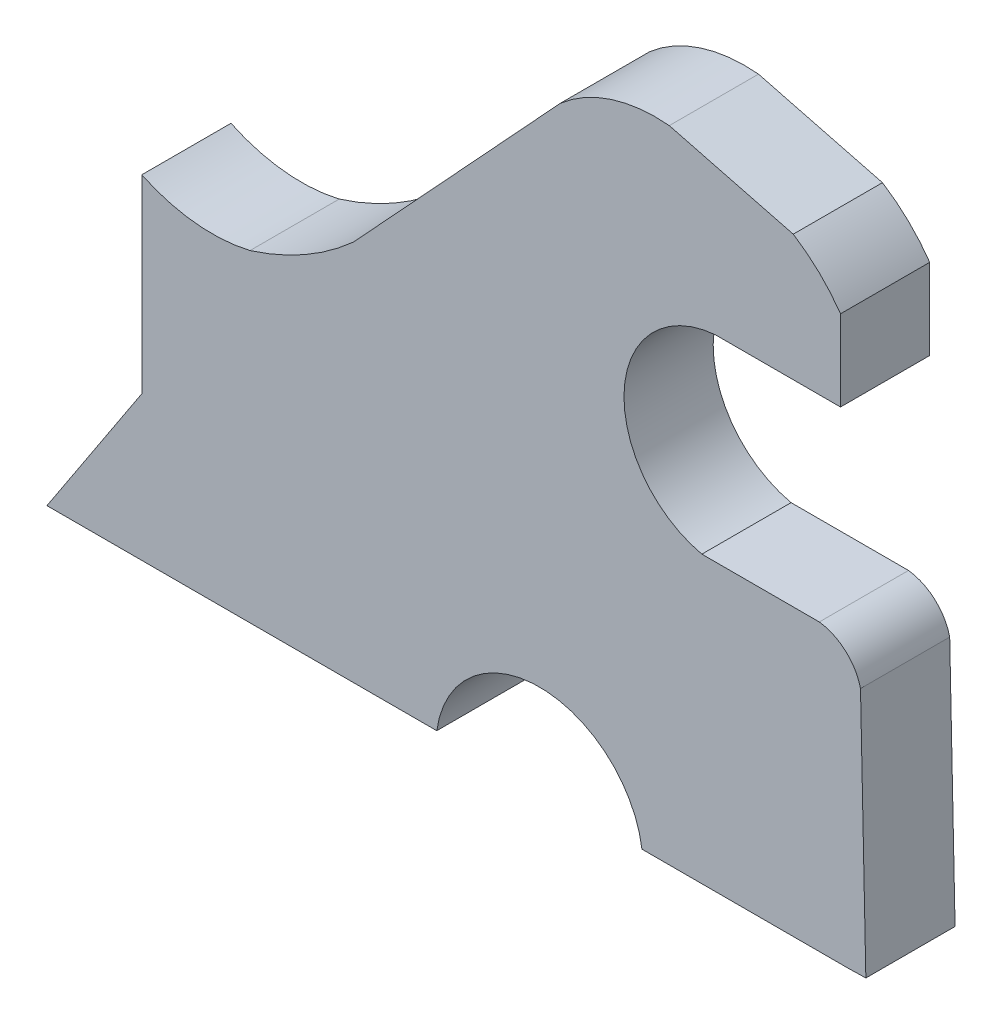
ISO-10303-21;
HEADER;
FILE_DESCRIPTION(('STEP AP214'),'2;1');
FILE_NAME('part.step','',(''),(''),'','','');
FILE_SCHEMA(('AUTOMOTIVE_DESIGN { 1 0 10303 214 1 1 1 1 }'));
ENDSEC;
DATA;
#1=APPLICATION_CONTEXT('core data for automotive mechanical design processes');
#2=APPLICATION_PROTOCOL_DEFINITION('international standard','automotive_design',2000,#1);
#3=PRODUCT_CONTEXT('',#1,'mechanical');
#4=PRODUCT('Part','Part','',(#3));
#5=PRODUCT_RELATED_PRODUCT_CATEGORY('part','',(#4));
#6=PRODUCT_DEFINITION_FORMATION('','',#4);
#7=PRODUCT_DEFINITION_CONTEXT('part definition',#1,'design');
#8=PRODUCT_DEFINITION('design','',#6,#7);
#9=PRODUCT_DEFINITION_SHAPE('','',#8);
#10=(LENGTH_UNIT() NAMED_UNIT(*) SI_UNIT(.MILLI.,.METRE.));
#11=(NAMED_UNIT(*) PLANE_ANGLE_UNIT() SI_UNIT($,.RADIAN.));
#12=(NAMED_UNIT(*) SI_UNIT($,.STERADIAN.) SOLID_ANGLE_UNIT());
#13=UNCERTAINTY_MEASURE_WITH_UNIT(LENGTH_MEASURE(1.E-05),#10,'distance_accuracy_value','');
#14=(GEOMETRIC_REPRESENTATION_CONTEXT(3) GLOBAL_UNCERTAINTY_ASSIGNED_CONTEXT((#13)) GLOBAL_UNIT_ASSIGNED_CONTEXT((#10,
#11,#12)) REPRESENTATION_CONTEXT('',''));
#15=CARTESIAN_POINT('',(0.,0.,0.));
#16=DIRECTION('',(0.,0.,1.));
#17=DIRECTION('',(1.,0.,0.));
#18=AXIS2_PLACEMENT_3D('',#15,#16,#17);
#19=CARTESIAN_POINT('',(0.,0.,50.));
#20=DIRECTION('',(0.835650834125528,-0.549261033958636,0.));
#21=DIRECTION('',(0.549261033958636,0.835650834125528,0.));
#22=AXIS2_PLACEMENT_3D('',#19,#20,#21);
#23=PLANE('',#22);
#24=DIRECTION('',(-0.549261033958636,-0.835650834125528,0.));
#25=VECTOR('',#24,1.);
#26=CARTESIAN_POINT('',(0.,0.,0.));
#27=LINE('',#26,#25);
#28=CARTESIAN_POINT('',(53.1496792922899,80.8624152964238,0.));
#29=VERTEX_POINT('',#28);
#30=CARTESIAN_POINT('',(0.,0.,0.));
#31=VERTEX_POINT('',#30);
#32=EDGE_CURVE('E199',#29,#31,#27,.T.);
#33=ORIENTED_EDGE('',*,*,#32,.T.);
#34=DIRECTION('',(0.,0.,-1.));
#35=VECTOR('',#34,1.);
#36=CARTESIAN_POINT('',(0.,0.,50.));
#37=LINE('',#36,#35);
#38=CARTESIAN_POINT('',(0.,0.,50.));
#39=VERTEX_POINT('',#38);
#40=EDGE_CURVE('E11',#39,#31,#37,.T.);
#41=ORIENTED_EDGE('',*,*,#40,.F.);
#42=DIRECTION('',(-0.549261033958636,-0.835650834125528,0.));
#43=VECTOR('',#42,1.);
#44=CARTESIAN_POINT('',(0.,0.,50.));
#45=LINE('',#44,#43);
#46=CARTESIAN_POINT('',(53.1496792922899,80.8624152964238,50.));
#47=VERTEX_POINT('',#46);
#48=EDGE_CURVE('E235',#47,#39,#45,.T.);
#49=ORIENTED_EDGE('',*,*,#48,.F.);
#50=DIRECTION('',(0.,0.,-1.));
#51=VECTOR('',#50,1.);
#52=CARTESIAN_POINT('',(53.1496792922899,80.8624152964238,50.));
#53=LINE('',#52,#51);
#54=EDGE_CURVE('E195',#47,#29,#53,.T.);
#55=ORIENTED_EDGE('',*,*,#54,.T.);
#56=EDGE_LOOP('',(#33,#41,#49,#55));
#57=FACE_BOUND('',#56,.T.);
#58=ADVANCED_FACE('F43',(#57),#23,.F.);
#59=CARTESIAN_POINT('',(0.,0.,50.));
#60=DIRECTION('',(0.,1.,0.));
#61=DIRECTION('',(-1.,0.,0.));
#62=AXIS2_PLACEMENT_3D('',#59,#60,#61);
#63=PLANE('',#62);
#64=DIRECTION('',(1.,0.,0.));
#65=VECTOR('',#64,1.);
#66=CARTESIAN_POINT('',(0.,0.,0.));
#67=LINE('',#66,#65);
#68=CARTESIAN_POINT('',(218.5,-1.85048510958686E-13,0.));
#69=VERTEX_POINT('',#68);
#70=EDGE_CURVE('E202',#31,#69,#67,.T.);
#71=ORIENTED_EDGE('',*,*,#70,.T.);
#72=DIRECTION('',(0.,0.,-1.));
#73=VECTOR('',#72,1.);
#74=CARTESIAN_POINT('',(218.5,-1.85048510958686E-13,50.));
#75=LINE('',#74,#73);
#76=CARTESIAN_POINT('',(218.5,-1.85048510958686E-13,50.));
#77=VERTEX_POINT('',#76);
#78=EDGE_CURVE('E51',#77,#69,#75,.T.);
#79=ORIENTED_EDGE('',*,*,#78,.F.);
#80=DIRECTION('',(1.,0.,0.));
#81=VECTOR('',#80,1.);
#82=CARTESIAN_POINT('',(0.,0.,50.));
#83=LINE('',#82,#81);
#84=EDGE_CURVE('E132',#39,#77,#83,.T.);
#85=ORIENTED_EDGE('',*,*,#84,.F.);
#86=ORIENTED_EDGE('',*,*,#40,.T.);
#87=EDGE_LOOP('',(#71,#79,#85,#86));
#88=FACE_BOUND('',#87,.T.);
#89=ADVANCED_FACE('F342',(#88),#63,.F.);
#90=CARTESIAN_POINT('',(276.,-8.06250000000019,50.));
#91=DIRECTION('',(0.,0.,-1.));
#92=DIRECTION('',(-1.,0.,0.));
#93=AXIS2_PLACEMENT_3D('',#90,#91,#92);
#94=CYLINDRICAL_SURFACE('',#93,58.0625);
#95=CARTESIAN_POINT('',(276.,-8.06250000000019,0.));
#96=DIRECTION('',(0.,0.,-1.));
#97=DIRECTION('',(-1.,0.,0.));
#98=AXIS2_PLACEMENT_3D('',#95,#96,#97);
#99=CIRCLE('',#98,58.0625);
#100=CARTESIAN_POINT('',(333.5,-1.94289029309402E-13,0.));
#101=VERTEX_POINT('',#100);
#102=EDGE_CURVE('E204',#69,#101,#99,.T.);
#103=ORIENTED_EDGE('',*,*,#102,.T.);
#104=DIRECTION('',(0.,0.,-1.));
#105=VECTOR('',#104,1.);
#106=CARTESIAN_POINT('',(333.5,-1.94289029309402E-13,50.));
#107=LINE('',#106,#105);
#108=CARTESIAN_POINT('',(333.5,-1.94289029309402E-13,50.));
#109=VERTEX_POINT('',#108);
#110=EDGE_CURVE('E272',#109,#101,#107,.T.);
#111=ORIENTED_EDGE('',*,*,#110,.F.);
#112=CARTESIAN_POINT('',(276.,-8.06250000000019,50.));
#113=DIRECTION('',(0.,0.,-1.));
#114=DIRECTION('',(-1.,0.,0.));
#115=AXIS2_PLACEMENT_3D('',#112,#113,#114);
#116=CIRCLE('',#115,58.0625);
#117=EDGE_CURVE('E280',#77,#109,#116,.T.);
#118=ORIENTED_EDGE('',*,*,#117,.F.);
#119=ORIENTED_EDGE('',*,*,#78,.T.);
#120=EDGE_LOOP('',(#103,#111,#118,#119));
#121=FACE_BOUND('',#120,.T.);
#122=ADVANCED_FACE('F278',(#121),#94,.F.);
#123=CARTESIAN_POINT('',(360.,0.,50.));
#124=DIRECTION('',(0.,1.,0.));
#125=DIRECTION('',(0.,0.,1.));
#126=AXIS2_PLACEMENT_3D('',#123,#124,#125);
#127=PLANE('',#126);
#128=DIRECTION('',(1.,0.,0.));
#129=VECTOR('',#128,1.);
#130=CARTESIAN_POINT('',(360.,0.,0.));
#131=LINE('',#130,#129);
#132=CARTESIAN_POINT('',(449.,0.,0.));
#133=VERTEX_POINT('',#132);
#134=EDGE_CURVE('E207',#101,#133,#131,.T.);
#135=ORIENTED_EDGE('',*,*,#134,.T.);
#136=DIRECTION('',(0.,0.,-1.));
#137=VECTOR('',#136,1.);
#138=CARTESIAN_POINT('',(449.,0.,50.));
#139=LINE('',#138,#137);
#140=CARTESIAN_POINT('',(449.,0.,50.));
#141=VERTEX_POINT('',#140);
#142=EDGE_CURVE('E269',#141,#133,#139,.T.);
#143=ORIENTED_EDGE('',*,*,#142,.F.);
#144=DIRECTION('',(1.,0.,0.));
#145=VECTOR('',#144,1.);
#146=CARTESIAN_POINT('',(333.5,-1.85048510958686E-13,50.));
#147=LINE('',#146,#145);
#148=EDGE_CURVE('E297',#109,#141,#147,.T.);
#149=ORIENTED_EDGE('',*,*,#148,.F.);
#150=ORIENTED_EDGE('',*,*,#110,.T.);
#151=EDGE_LOOP('',(#135,#143,#149,#150));
#152=FACE_BOUND('',#151,.T.);
#153=ADVANCED_FACE('F288',(#152),#127,.F.);
#154=CARTESIAN_POINT('',(449.,0.,50.));
#155=DIRECTION('',(-0.0215777087943383,0.999767174137652,0.));
#156=DIRECTION('',(-0.999767174137652,-0.0215777087943383,0.));
#157=AXIS2_PLACEMENT_3D('',#154,#155,#156);
#158=PLANE('',#157);
#159=DIRECTION('',(0.999767174137652,0.0215777087943383,0.));
#160=VECTOR('',#159,1.);
#161=CARTESIAN_POINT('',(449.,0.,0.));
#162=LINE('',#161,#160);
#163=CARTESIAN_POINT('',(458.997671741377,0.215777087943382,0.));
#164=VERTEX_POINT('',#163);
#165=EDGE_CURVE('E209',#133,#164,#162,.T.);
#166=ORIENTED_EDGE('',*,*,#165,.T.);
#167=DIRECTION('',(0.,0.,-1.));
#168=VECTOR('',#167,1.);
#169=CARTESIAN_POINT('',(458.997671741377,0.215777087943382,50.));
#170=LINE('',#169,#168);
#171=CARTESIAN_POINT('',(458.997671741377,0.215777087943382,50.));
#172=VERTEX_POINT('',#171);
#173=EDGE_CURVE('E266',#172,#164,#170,.T.);
#174=ORIENTED_EDGE('',*,*,#173,.F.);
#175=DIRECTION('',(0.999767174137652,0.0215777087943383,0.));
#176=VECTOR('',#175,1.);
#177=CARTESIAN_POINT('',(449.,0.,50.));
#178=LINE('',#177,#176);
#179=EDGE_CURVE('E294',#141,#172,#178,.T.);
#180=ORIENTED_EDGE('',*,*,#179,.F.);
#181=ORIENTED_EDGE('',*,*,#142,.T.);
#182=EDGE_LOOP('',(#166,#174,#180,#181));
#183=FACE_BOUND('',#182,.T.);
#184=ADVANCED_FACE('F292',(#183),#158,.F.);
#185=CARTESIAN_POINT('',(458.997671741377,0.215777087943382,50.));
#186=DIRECTION('',(-0.999767174137652,-0.0215777087943382,0.));
#187=DIRECTION('',(0.0215777087943382,-0.999767174137652,0.));
#188=AXIS2_PLACEMENT_3D('',#185,#186,#187);
#189=PLANE('',#188);
#190=DIRECTION('',(-0.0215777087943382,0.999767174137652,0.));
#191=VECTOR('',#190,1.);
#192=CARTESIAN_POINT('',(458.997671741377,0.215777087943382,0.));
#193=LINE('',#192,#191);
#194=CARTESIAN_POINT('',(455.997671741376,139.215777087943,0.));
#195=VERTEX_POINT('',#194);
#196=EDGE_CURVE('E211',#164,#195,#193,.T.);
#197=ORIENTED_EDGE('',*,*,#196,.T.);
#198=DIRECTION('',(0.,0.,-1.));
#199=VECTOR('',#198,1.);
#200=CARTESIAN_POINT('',(455.997671741376,139.215777087943,50.));
#201=LINE('',#200,#199);
#202=CARTESIAN_POINT('',(455.997671741376,139.215777087943,50.));
#203=VERTEX_POINT('',#202);
#204=EDGE_CURVE('E263',#203,#195,#201,.T.);
#205=ORIENTED_EDGE('',*,*,#204,.F.);
#206=DIRECTION('',(-0.0215777087943382,0.999767174137652,0.));
#207=VECTOR('',#206,1.);
#208=CARTESIAN_POINT('',(458.997671741377,0.215777087943382,50.));
#209=LINE('',#208,#207);
#210=EDGE_CURVE('E296',#172,#203,#209,.T.);
#211=ORIENTED_EDGE('',*,*,#210,.F.);
#212=ORIENTED_EDGE('',*,*,#173,.T.);
#213=EDGE_LOOP('',(#197,#205,#211,#212));
#214=FACE_BOUND('',#213,.T.);
#215=ADVANCED_FACE('F355',(#214),#189,.F.);
#216=CARTESIAN_POINT('',(429.438930997848,132.928764738813,50.));
#217=DIRECTION('',(0.,0.,-1.));
#218=DIRECTION('',(-1.,0.,0.));
#219=AXIS2_PLACEMENT_3D('',#216,#217,#218);
#220=CYLINDRICAL_SURFACE('',#219,27.2927322589741);
#221=CARTESIAN_POINT('',(429.438930997848,132.928764738813,0.));
#222=DIRECTION('',(0.,0.,1.));
#223=DIRECTION('',(1.,0.,0.));
#224=AXIS2_PLACEMENT_3D('',#221,#222,#223);
#225=CIRCLE('',#224,27.2927322589741);
#226=CARTESIAN_POINT('',(432.909011053631,160.,0.));
#227=VERTEX_POINT('',#226);
#228=EDGE_CURVE('E213',#195,#227,#225,.T.);
#229=ORIENTED_EDGE('',*,*,#228,.T.);
#230=DIRECTION('',(0.,0.,-1.));
#231=VECTOR('',#230,1.);
#232=CARTESIAN_POINT('',(432.909011053631,160.,50.));
#233=LINE('',#232,#231);
#234=CARTESIAN_POINT('',(432.909011053631,160.,50.));
#235=VERTEX_POINT('',#234);
#236=EDGE_CURVE('E260',#235,#227,#233,.T.);
#237=ORIENTED_EDGE('',*,*,#236,.F.);
#238=CARTESIAN_POINT('',(429.438930997848,132.928764738813,50.));
#239=DIRECTION('',(0.,0.,1.));
#240=DIRECTION('',(1.,0.,0.));
#241=AXIS2_PLACEMENT_3D('',#238,#239,#240);
#242=CIRCLE('',#241,27.2927322589741);
#243=EDGE_CURVE('E299',#203,#235,#242,.T.);
#244=ORIENTED_EDGE('',*,*,#243,.F.);
#245=ORIENTED_EDGE('',*,*,#204,.T.);
#246=EDGE_LOOP('',(#229,#237,#244,#245));
#247=FACE_BOUND('',#246,.T.);
#248=ADVANCED_FACE('F358',(#247),#220,.T.);
#249=CARTESIAN_POINT('',(432.909011053631,160.,50.));
#250=DIRECTION('',(0.,-1.,0.));
#251=DIRECTION('',(0.,0.,-1.));
#252=AXIS2_PLACEMENT_3D('',#249,#250,#251);
#253=PLANE('',#252);
#254=DIRECTION('',(-1.,0.,0.));
#255=VECTOR('',#254,1.);
#256=CARTESIAN_POINT('',(432.909011053631,160.,0.));
#257=LINE('',#256,#255);
#258=CARTESIAN_POINT('',(367.081412811432,160.,0.));
#259=VERTEX_POINT('',#258);
#260=EDGE_CURVE('E215',#227,#259,#257,.T.);
#261=ORIENTED_EDGE('',*,*,#260,.T.);
#262=DIRECTION('',(0.,0.,-1.));
#263=VECTOR('',#262,1.);
#264=CARTESIAN_POINT('',(367.081412811432,160.,50.));
#265=LINE('',#264,#263);
#266=CARTESIAN_POINT('',(367.081412811432,160.,50.));
#267=VERTEX_POINT('',#266);
#268=EDGE_CURVE('E257',#267,#259,#265,.T.);
#269=ORIENTED_EDGE('',*,*,#268,.F.);
#270=DIRECTION('',(-1.,0.,0.));
#271=VECTOR('',#270,1.);
#272=CARTESIAN_POINT('',(432.909011053631,160.,50.));
#273=LINE('',#272,#271);
#274=EDGE_CURVE('E305',#235,#267,#273,.T.);
#275=ORIENTED_EDGE('',*,*,#274,.F.);
#276=ORIENTED_EDGE('',*,*,#236,.T.);
#277=EDGE_LOOP('',(#261,#269,#275,#276));
#278=FACE_BOUND('',#277,.T.);
#279=ADVANCED_FACE('F362',(#278),#253,.F.);
#280=CARTESIAN_POINT('',(379.346158880396,214.556439421034,50.));
#281=DIRECTION('',(0.,0.,-1.));
#282=DIRECTION('',(-1.,0.,0.));
#283=AXIS2_PLACEMENT_3D('',#280,#281,#282);
#284=CYLINDRICAL_SURFACE('',#283,55.918056819217);
#285=CARTESIAN_POINT('',(379.346158880396,214.556439421034,0.));
#286=DIRECTION('',(0.,0.,-1.));
#287=DIRECTION('',(1.,0.,0.));
#288=AXIS2_PLACEMENT_3D('',#285,#286,#287);
#289=CIRCLE('',#288,55.918056819217);
#290=CARTESIAN_POINT('',(374.51374395469,270.265297284241,0.));
#291=VERTEX_POINT('',#290);
#292=EDGE_CURVE('E217',#259,#291,#289,.T.);
#293=ORIENTED_EDGE('',*,*,#292,.T.);
#294=DIRECTION('',(0.,0.,-1.));
#295=VECTOR('',#294,1.);
#296=CARTESIAN_POINT('',(374.51374395469,270.265297284241,50.));
#297=LINE('',#296,#295);
#298=CARTESIAN_POINT('',(374.51374395469,270.265297284241,50.));
#299=VERTEX_POINT('',#298);
#300=EDGE_CURVE('E254',#299,#291,#297,.T.);
#301=ORIENTED_EDGE('',*,*,#300,.F.);
#302=CARTESIAN_POINT('',(379.346158880396,214.556439421034,50.));
#303=DIRECTION('',(0.,0.,-1.));
#304=DIRECTION('',(1.,0.,0.));
#305=AXIS2_PLACEMENT_3D('',#302,#303,#304);
#306=CIRCLE('',#305,55.918056819217);
#307=EDGE_CURVE('E307',#267,#299,#306,.T.);
#308=ORIENTED_EDGE('',*,*,#307,.F.);
#309=ORIENTED_EDGE('',*,*,#268,.T.);
#310=EDGE_LOOP('',(#293,#301,#308,#309));
#311=FACE_BOUND('',#310,.T.);
#312=ADVANCED_FACE('F366',(#311),#284,.F.);
#313=CARTESIAN_POINT('',(434.798113420847,270.265297284241,50.));
#314=DIRECTION('',(0.,1.,0.));
#315=DIRECTION('',(0.,0.,1.));
#316=AXIS2_PLACEMENT_3D('',#313,#314,#315);
#317=PLANE('',#316);
#318=DIRECTION('',(1.,0.,0.));
#319=VECTOR('',#318,1.);
#320=CARTESIAN_POINT('',(434.798113420847,270.265297284241,0.));
#321=LINE('',#320,#319);
#322=CARTESIAN_POINT('',(444.798113420847,270.265297284241,0.));
#323=VERTEX_POINT('',#322);
#324=EDGE_CURVE('E220',#291,#323,#321,.T.);
#325=ORIENTED_EDGE('',*,*,#324,.T.);
#326=DIRECTION('',(0.,0.,-1.));
#327=VECTOR('',#326,1.);
#328=CARTESIAN_POINT('',(444.798113420847,270.265297284241,50.));
#329=LINE('',#328,#327);
#330=CARTESIAN_POINT('',(444.798113420847,270.265297284241,50.));
#331=VERTEX_POINT('',#330);
#332=EDGE_CURVE('E251',#331,#323,#329,.T.);
#333=ORIENTED_EDGE('',*,*,#332,.F.);
#334=DIRECTION('',(1.,0.,0.));
#335=VECTOR('',#334,1.);
#336=CARTESIAN_POINT('',(374.51374395469,270.265297284241,50.));
#337=LINE('',#336,#335);
#338=EDGE_CURVE('E309',#299,#331,#337,.T.);
#339=ORIENTED_EDGE('',*,*,#338,.F.);
#340=ORIENTED_EDGE('',*,*,#300,.T.);
#341=EDGE_LOOP('',(#325,#333,#339,#340));
#342=FACE_BOUND('',#341,.T.);
#343=ADVANCED_FACE('F370',(#342),#317,.F.);
#344=CARTESIAN_POINT('',(444.798113420847,270.265297284241,50.));
#345=DIRECTION('',(-1.,0.,0.));
#346=DIRECTION('',(0.,0.,1.));
#347=AXIS2_PLACEMENT_3D('',#344,#345,#346);
#348=PLANE('',#347);
#349=DIRECTION('',(0.,1.,0.));
#350=VECTOR('',#349,1.);
#351=CARTESIAN_POINT('',(444.798113420847,270.265297284241,0.));
#352=LINE('',#351,#350);
#353=CARTESIAN_POINT('',(444.798113420847,315.516988045478,0.));
#354=VERTEX_POINT('',#353);
#355=EDGE_CURVE('E222',#323,#354,#352,.T.);
#356=ORIENTED_EDGE('',*,*,#355,.T.);
#357=DIRECTION('',(0.,0.,-1.));
#358=VECTOR('',#357,1.);
#359=CARTESIAN_POINT('',(444.798113420847,315.516988045478,50.));
#360=LINE('',#359,#358);
#361=CARTESIAN_POINT('',(444.798113420847,315.516988045478,50.));
#362=VERTEX_POINT('',#361);
#363=EDGE_CURVE('E248',#362,#354,#360,.T.);
#364=ORIENTED_EDGE('',*,*,#363,.F.);
#365=DIRECTION('',(0.,1.,0.));
#366=VECTOR('',#365,1.);
#367=CARTESIAN_POINT('',(444.798113420847,270.265297284241,50.));
#368=LINE('',#367,#366);
#369=EDGE_CURVE('E311',#331,#362,#368,.T.);
#370=ORIENTED_EDGE('',*,*,#369,.F.);
#371=ORIENTED_EDGE('',*,*,#332,.T.);
#372=EDGE_LOOP('',(#356,#364,#370,#371));
#373=FACE_BOUND('',#372,.T.);
#374=ADVANCED_FACE('F374',(#373),#348,.F.);
#375=CARTESIAN_POINT('',(368.736105653195,262.752666833737,50.));
#376=DIRECTION('',(0.,0.,-1.));
#377=DIRECTION('',(-1.,0.,0.));
#378=AXIS2_PLACEMENT_3D('',#375,#376,#377);
#379=CYLINDRICAL_SURFACE('',#378,92.5716080587468);
#380=CARTESIAN_POINT('',(368.736105653195,262.752666833737,0.));
#381=DIRECTION('',(0.,0.,1.));
#382=DIRECTION('',(1.,0.,0.));
#383=AXIS2_PLACEMENT_3D('',#380,#381,#382);
#384=CIRCLE('',#383,92.5716080587468);
#385=CARTESIAN_POINT('',(418.309236409378,340.93199482786,0.));
#386=VERTEX_POINT('',#385);
#387=EDGE_CURVE('E224',#354,#386,#384,.T.);
#388=ORIENTED_EDGE('',*,*,#387,.T.);
#389=DIRECTION('',(0.,0.,-1.));
#390=VECTOR('',#389,1.);
#391=CARTESIAN_POINT('',(418.309236409378,340.93199482786,50.));
#392=LINE('',#391,#390);
#393=CARTESIAN_POINT('',(418.309236409378,340.93199482786,50.));
#394=VERTEX_POINT('',#393);
#395=EDGE_CURVE('E245',#394,#386,#392,.T.);
#396=ORIENTED_EDGE('',*,*,#395,.F.);
#397=CARTESIAN_POINT('',(368.736105653195,262.752666833737,50.));
#398=DIRECTION('',(0.,0.,1.));
#399=DIRECTION('',(1.,0.,0.));
#400=AXIS2_PLACEMENT_3D('',#397,#398,#399);
#401=CIRCLE('',#400,92.5716080587468);
#402=EDGE_CURVE('E313',#362,#394,#401,.T.);
#403=ORIENTED_EDGE('',*,*,#402,.F.);
#404=ORIENTED_EDGE('',*,*,#363,.T.);
#405=EDGE_LOOP('',(#388,#396,#403,#404));
#406=FACE_BOUND('',#405,.T.);
#407=ADVANCED_FACE('F378',(#406),#379,.T.);
#408=CARTESIAN_POINT('',(418.309236409378,340.93199482786,50.));
#409=DIRECTION('',(-0.24987801902177,-0.968277323709358,0.));
#410=DIRECTION('',(0.968277323709358,-0.24987801902177,0.));
#411=AXIS2_PLACEMENT_3D('',#408,#409,#410);
#412=PLANE('',#411);
#413=DIRECTION('',(-0.968277323709358,0.24987801902177,0.));
#414=VECTOR('',#413,1.);
#415=CARTESIAN_POINT('',(418.309236409378,340.93199482786,0.));
#416=LINE('',#415,#414);
#417=CARTESIAN_POINT('',(348.808103311726,358.867771111125,0.));
#418=VERTEX_POINT('',#417);
#419=EDGE_CURVE('E226',#386,#418,#416,.T.);
#420=ORIENTED_EDGE('',*,*,#419,.T.);
#421=DIRECTION('',(0.,0.,-1.));
#422=VECTOR('',#421,1.);
#423=CARTESIAN_POINT('',(348.808103311726,358.867771111125,50.));
#424=LINE('',#423,#422);
#425=CARTESIAN_POINT('',(348.808103311726,358.867771111125,50.));
#426=VERTEX_POINT('',#425);
#427=EDGE_CURVE('E242',#426,#418,#424,.T.);
#428=ORIENTED_EDGE('',*,*,#427,.F.);
#429=DIRECTION('',(-0.968277323709358,0.24987801902177,0.));
#430=VECTOR('',#429,1.);
#431=CARTESIAN_POINT('',(418.309236409378,340.93199482786,50.));
#432=LINE('',#431,#430);
#433=EDGE_CURVE('E315',#394,#426,#432,.T.);
#434=ORIENTED_EDGE('',*,*,#433,.F.);
#435=ORIENTED_EDGE('',*,*,#395,.T.);
#436=EDGE_LOOP('',(#420,#428,#434,#435));
#437=FACE_BOUND('',#436,.T.);
#438=ADVANCED_FACE('F382',(#437),#412,.F.);
#439=CARTESIAN_POINT('',(341.181607074523,277.945602435,50.));
#440=DIRECTION('',(0.,0.,-1.));
#441=DIRECTION('',(-1.,0.,0.));
#442=AXIS2_PLACEMENT_3D('',#439,#440,#441);
#443=CYLINDRICAL_SURFACE('',#442,81.2807531221461);
#444=CARTESIAN_POINT('',(341.181607074523,277.945602435,0.));
#445=DIRECTION('',(0.,0.,1.));
#446=DIRECTION('',(-1.,0.,0.));
#447=AXIS2_PLACEMENT_3D('',#444,#445,#446);
#448=CIRCLE('',#447,81.2807531221461);
#449=CARTESIAN_POINT('',(287.772711056013,339.215910531069,0.));
#450=VERTEX_POINT('',#449);
#451=EDGE_CURVE('E228',#418,#450,#448,.T.);
#452=ORIENTED_EDGE('',*,*,#451,.T.);
#453=DIRECTION('',(0.,0.,-1.));
#454=VECTOR('',#453,1.);
#455=CARTESIAN_POINT('',(287.772711056013,339.215910531069,50.));
#456=LINE('',#455,#454);
#457=CARTESIAN_POINT('',(287.772711056013,339.215910531069,50.));
#458=VERTEX_POINT('',#457);
#459=EDGE_CURVE('E239',#458,#450,#456,.T.);
#460=ORIENTED_EDGE('',*,*,#459,.F.);
#461=CARTESIAN_POINT('',(341.181607074523,277.945602435,50.));
#462=DIRECTION('',(0.,0.,1.));
#463=DIRECTION('',(-1.,0.,0.));
#464=AXIS2_PLACEMENT_3D('',#461,#462,#463);
#465=CIRCLE('',#464,81.2807531221461);
#466=EDGE_CURVE('E317',#426,#458,#465,.T.);
#467=ORIENTED_EDGE('',*,*,#466,.F.);
#468=ORIENTED_EDGE('',*,*,#427,.T.);
#469=EDGE_LOOP('',(#452,#460,#467,#468));
#470=FACE_BOUND('',#469,.T.);
#471=ADVANCED_FACE('F323',(#470),#443,.T.);
#472=CARTESIAN_POINT('',(171.828858078544,213.87929068241,50.));
#473=DIRECTION('',(0.734077602109996,-0.679065588938534,0.));
#474=DIRECTION('',(0.679065588938534,0.734077602109996,0.));
#475=AXIS2_PLACEMENT_3D('',#472,#473,#474);
#476=PLANE('',#475);
#477=DIRECTION('',(-0.679065588938534,-0.734077602109996,0.));
#478=VECTOR('',#477,1.);
#479=CARTESIAN_POINT('',(171.828858078544,213.87929068241,0.));
#480=LINE('',#479,#478);
#481=CARTESIAN_POINT('',(171.828858078544,213.87929068241,0.));
#482=VERTEX_POINT('',#481);
#483=EDGE_CURVE('E230',#450,#482,#480,.T.);
#484=ORIENTED_EDGE('',*,*,#483,.T.);
#485=DIRECTION('',(0.,0.,-1.));
#486=VECTOR('',#485,1.);
#487=CARTESIAN_POINT('',(171.828858078544,213.87929068241,50.));
#488=LINE('',#487,#486);
#489=CARTESIAN_POINT('',(171.828858078544,213.87929068241,50.));
#490=VERTEX_POINT('',#489);
#491=EDGE_CURVE('E190',#490,#482,#488,.T.);
#492=ORIENTED_EDGE('',*,*,#491,.F.);
#493=DIRECTION('',(-0.679065588938534,-0.734077602109996,0.));
#494=VECTOR('',#493,1.);
#495=CARTESIAN_POINT('',(171.828858078544,213.87929068241,50.));
#496=LINE('',#495,#494);
#497=EDGE_CURVE('E181',#458,#490,#496,.T.);
#498=ORIENTED_EDGE('',*,*,#497,.F.);
#499=ORIENTED_EDGE('',*,*,#459,.T.);
#500=EDGE_LOOP('',(#484,#492,#498,#499));
#501=FACE_BOUND('',#500,.T.);
#502=ADVANCED_FACE('F327',(#501),#476,.F.);
#503=CARTESIAN_POINT('',(67.1240720574184,329.769358385602,50.));
#504=DIRECTION('',(0.,0.,-1.));
#505=DIRECTION('',(-1.,0.,0.));
#506=AXIS2_PLACEMENT_3D('',#503,#504,#505);
#507=CYLINDRICAL_SURFACE('',#506,156.184506299377);
#508=CARTESIAN_POINT('',(67.1240720574184,329.769358385602,0.));
#509=DIRECTION('',(0.,0.,-1.));
#510=DIRECTION('',(1.,0.,0.));
#511=AXIS2_PLACEMENT_3D('',#508,#509,#510);
#512=CIRCLE('',#511,156.184506299377);
#513=CARTESIAN_POINT('',(113.814091907408,180.726941421882,0.));
#514=VERTEX_POINT('',#513);
#515=EDGE_CURVE('E189',#482,#514,#512,.T.);
#516=ORIENTED_EDGE('',*,*,#515,.T.);
#517=DIRECTION('',(0.,0.,-1.));
#518=VECTOR('',#517,1.);
#519=CARTESIAN_POINT('',(113.814091907408,180.726941421882,50.));
#520=LINE('',#519,#518);
#521=CARTESIAN_POINT('',(113.814091907408,180.726941421882,50.));
#522=VERTEX_POINT('',#521);
#523=EDGE_CURVE('E186',#522,#514,#520,.T.);
#524=ORIENTED_EDGE('',*,*,#523,.F.);
#525=CARTESIAN_POINT('',(67.1240720574184,329.769358385602,50.));
#526=DIRECTION('',(0.,0.,-1.));
#527=DIRECTION('',(1.,0.,0.));
#528=AXIS2_PLACEMENT_3D('',#525,#526,#527);
#529=CIRCLE('',#528,156.184506299377);
#530=EDGE_CURVE('E175',#490,#522,#529,.T.);
#531=ORIENTED_EDGE('',*,*,#530,.F.);
#532=ORIENTED_EDGE('',*,*,#491,.T.);
#533=EDGE_LOOP('',(#516,#524,#531,#532));
#534=FACE_BOUND('',#533,.T.);
#535=ADVANCED_FACE('F187',(#534),#507,.F.);
#536=CARTESIAN_POINT('',(92.6595700148874,270.265297284241,50.));
#537=DIRECTION('',(0.,0.,-1.));
#538=DIRECTION('',(-1.,0.,0.));
#539=AXIS2_PLACEMENT_3D('',#536,#537,#538);
#540=CYLINDRICAL_SURFACE('',#539,92.0034291047661);
#541=CARTESIAN_POINT('',(92.6595700148874,270.265297284241,0.));
#542=DIRECTION('',(0.,0.,-1.));
#543=DIRECTION('',(1.,0.,0.));
#544=AXIS2_PLACEMENT_3D('',#541,#542,#543);
#545=CIRCLE('',#544,92.0034291047661);
#546=CARTESIAN_POINT('',(53.1496792922899,187.177395023298,0.));
#547=VERTEX_POINT('',#546);
#548=EDGE_CURVE('E118',#514,#547,#545,.T.);
#549=ORIENTED_EDGE('',*,*,#548,.T.);
#550=DIRECTION('',(0.,0.,-1.));
#551=VECTOR('',#550,1.);
#552=CARTESIAN_POINT('',(53.1496792922899,187.177395023298,50.));
#553=LINE('',#552,#551);
#554=CARTESIAN_POINT('',(53.1496792922899,187.177395023298,50.));
#555=VERTEX_POINT('',#554);
#556=EDGE_CURVE('E191',#555,#547,#553,.T.);
#557=ORIENTED_EDGE('',*,*,#556,.F.);
#558=CARTESIAN_POINT('',(92.6595700148874,270.265297284241,50.));
#559=DIRECTION('',(0.,0.,-1.));
#560=DIRECTION('',(1.,0.,0.));
#561=AXIS2_PLACEMENT_3D('',#558,#559,#560);
#562=CIRCLE('',#561,92.0034291047661);
#563=EDGE_CURVE('E179',#522,#555,#562,.T.);
#564=ORIENTED_EDGE('',*,*,#563,.F.);
#565=ORIENTED_EDGE('',*,*,#523,.T.);
#566=EDGE_LOOP('',(#549,#557,#564,#565));
#567=FACE_BOUND('',#566,.T.);
#568=ADVANCED_FACE('F193',(#567),#540,.F.);
#569=CARTESIAN_POINT('',(53.1496792922899,187.177395023298,50.));
#570=DIRECTION('',(1.,0.,0.));
#571=DIRECTION('',(0.,1.,0.));
#572=AXIS2_PLACEMENT_3D('',#569,#570,#571);
#573=PLANE('',#572);
#574=DIRECTION('',(0.,-1.,0.));
#575=VECTOR('',#574,1.);
#576=CARTESIAN_POINT('',(53.1496792922899,187.177395023298,0.));
#577=LINE('',#576,#575);
#578=EDGE_CURVE('E124',#547,#29,#577,.T.);
#579=ORIENTED_EDGE('',*,*,#578,.T.);
#580=ORIENTED_EDGE('',*,*,#54,.F.);
#581=DIRECTION('',(0.,-1.,0.));
#582=VECTOR('',#581,1.);
#583=CARTESIAN_POINT('',(53.1496792922899,187.177395023298,50.));
#584=LINE('',#583,#582);
#585=EDGE_CURVE('E59',#555,#47,#584,.T.);
#586=ORIENTED_EDGE('',*,*,#585,.F.);
#587=ORIENTED_EDGE('',*,*,#556,.T.);
#588=EDGE_LOOP('',(#579,#580,#586,#587));
#589=FACE_BOUND('',#588,.T.);
#590=ADVANCED_FACE('F331',(#589),#573,.F.);
#591=CARTESIAN_POINT('',(92.6595700148874,270.265297284241,50.));
#592=DIRECTION('',(0.,0.,1.));
#593=DIRECTION('',(1.,0.,0.));
#594=AXIS2_PLACEMENT_3D('',#591,#592,#593);
#595=PLANE('',#594);
#596=ORIENTED_EDGE('',*,*,#48,.T.);
#597=ORIENTED_EDGE('',*,*,#84,.T.);
#598=ORIENTED_EDGE('',*,*,#117,.T.);
#599=ORIENTED_EDGE('',*,*,#148,.T.);
#600=ORIENTED_EDGE('',*,*,#179,.T.);
#601=ORIENTED_EDGE('',*,*,#210,.T.);
#602=ORIENTED_EDGE('',*,*,#243,.T.);
#603=ORIENTED_EDGE('',*,*,#274,.T.);
#604=ORIENTED_EDGE('',*,*,#307,.T.);
#605=ORIENTED_EDGE('',*,*,#338,.T.);
#606=ORIENTED_EDGE('',*,*,#369,.T.);
#607=ORIENTED_EDGE('',*,*,#402,.T.);
#608=ORIENTED_EDGE('',*,*,#433,.T.);
#609=ORIENTED_EDGE('',*,*,#466,.T.);
#610=ORIENTED_EDGE('',*,*,#497,.T.);
#611=ORIENTED_EDGE('',*,*,#530,.T.);
#612=ORIENTED_EDGE('',*,*,#563,.T.);
#613=ORIENTED_EDGE('',*,*,#585,.T.);
#614=EDGE_LOOP('',(#596,#597,#598,#599,#600,#601,#602,#603,#604,#605,#606,#607,#608,#609,#610,
#611,#612,#613));
#615=FACE_BOUND('',#614,.T.);
#616=ADVANCED_FACE('F177',(#615),#595,.T.);
#617=CARTESIAN_POINT('',(92.6595700148874,270.265297284241,0.));
#618=DIRECTION('',(0.,0.,1.));
#619=DIRECTION('',(1.,0.,0.));
#620=AXIS2_PLACEMENT_3D('',#617,#618,#619);
#621=PLANE('',#620);
#622=ORIENTED_EDGE('',*,*,#32,.F.);
#623=ORIENTED_EDGE('',*,*,#578,.F.);
#624=ORIENTED_EDGE('',*,*,#548,.F.);
#625=ORIENTED_EDGE('',*,*,#515,.F.);
#626=ORIENTED_EDGE('',*,*,#483,.F.);
#627=ORIENTED_EDGE('',*,*,#451,.F.);
#628=ORIENTED_EDGE('',*,*,#419,.F.);
#629=ORIENTED_EDGE('',*,*,#387,.F.);
#630=ORIENTED_EDGE('',*,*,#355,.F.);
#631=ORIENTED_EDGE('',*,*,#324,.F.);
#632=ORIENTED_EDGE('',*,*,#292,.F.);
#633=ORIENTED_EDGE('',*,*,#260,.F.);
#634=ORIENTED_EDGE('',*,*,#228,.F.);
#635=ORIENTED_EDGE('',*,*,#196,.F.);
#636=ORIENTED_EDGE('',*,*,#165,.F.);
#637=ORIENTED_EDGE('',*,*,#134,.F.);
#638=ORIENTED_EDGE('',*,*,#102,.F.);
#639=ORIENTED_EDGE('',*,*,#70,.F.);
#640=EDGE_LOOP('',(#622,#623,#624,#625,#626,#627,#628,#629,#630,#631,#632,#633,#634,#635,#636,
#637,#638,#639));
#641=FACE_BOUND('',#640,.T.);
#642=ADVANCED_FACE('F283',(#641),#621,.F.);
#643=CLOSED_SHELL('',(#58,#89,#122,#153,#184,#215,#248,#279,#312,#343,#374,#407,#438,#471,#502,
#535,#568,#590,#616,#642));
#644=MANIFOLD_SOLID_BREP('B2',#643);
#645=ADVANCED_BREP_SHAPE_REPRESENTATION('',(#18,#644),#14);
#646=SHAPE_DEFINITION_REPRESENTATION(#9,#645);
ENDSEC;
END-ISO-10303-21;
